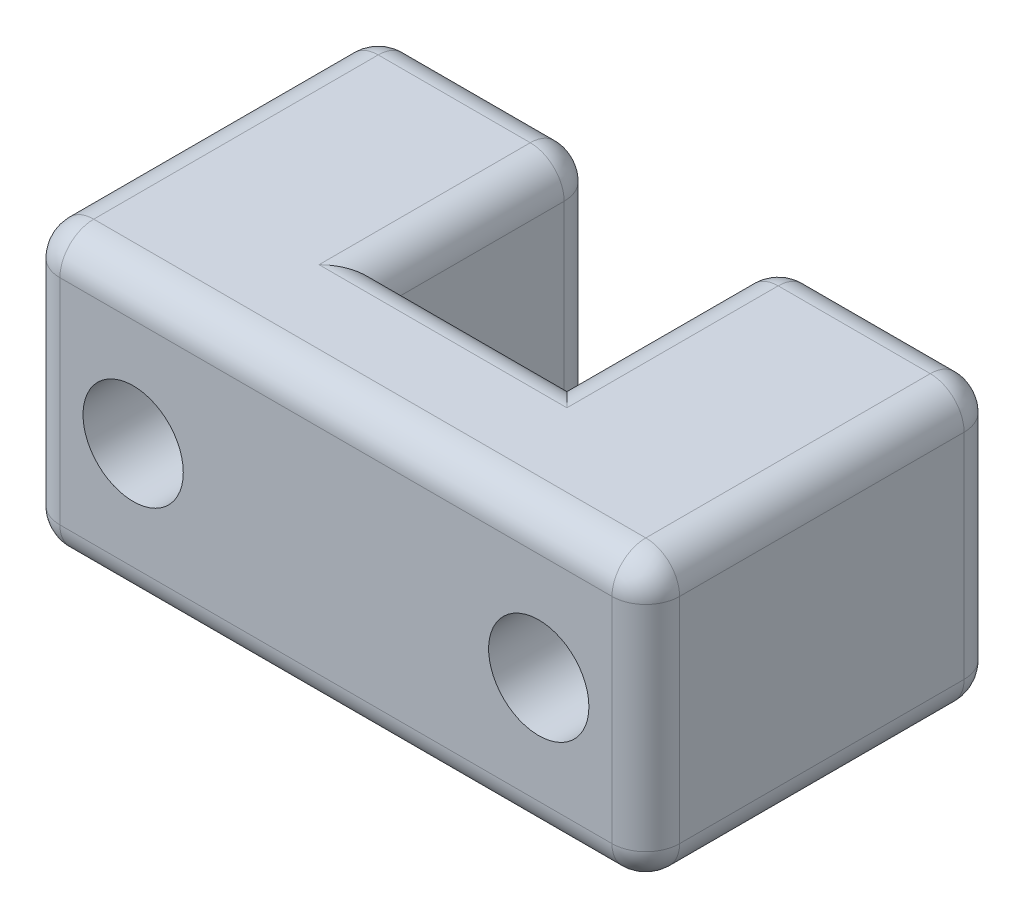
ISO-10303-21;
HEADER;
FILE_DESCRIPTION(('STEP AP214'),'2;1');
FILE_NAME('part.step','',(''),(''),'','','');
FILE_SCHEMA(('AUTOMOTIVE_DESIGN { 1 0 10303 214 1 1 1 1 }'));
ENDSEC;
DATA;
#1=APPLICATION_CONTEXT('core data for automotive mechanical design processes');
#2=APPLICATION_PROTOCOL_DEFINITION('international standard','automotive_design',2000,#1);
#3=PRODUCT_CONTEXT('',#1,'mechanical');
#4=PRODUCT('Part','Part','',(#3));
#5=PRODUCT_RELATED_PRODUCT_CATEGORY('part','',(#4));
#6=PRODUCT_DEFINITION_FORMATION('','',#4);
#7=PRODUCT_DEFINITION_CONTEXT('part definition',#1,'design');
#8=PRODUCT_DEFINITION('design','',#6,#7);
#9=PRODUCT_DEFINITION_SHAPE('','',#8);
#10=(LENGTH_UNIT() NAMED_UNIT(*) SI_UNIT(.MILLI.,.METRE.));
#11=(NAMED_UNIT(*) PLANE_ANGLE_UNIT() SI_UNIT($,.RADIAN.));
#12=(NAMED_UNIT(*) SI_UNIT($,.STERADIAN.) SOLID_ANGLE_UNIT());
#13=UNCERTAINTY_MEASURE_WITH_UNIT(LENGTH_MEASURE(1.E-05),#10,'distance_accuracy_value','');
#14=(GEOMETRIC_REPRESENTATION_CONTEXT(3) GLOBAL_UNCERTAINTY_ASSIGNED_CONTEXT((#13)) GLOBAL_UNIT_ASSIGNED_CONTEXT((#10,
#11,#12)) REPRESENTATION_CONTEXT('',''));
#15=CARTESIAN_POINT('',(0.,0.,0.));
#16=DIRECTION('',(0.,0.,1.));
#17=DIRECTION('',(1.,0.,0.));
#18=AXIS2_PLACEMENT_3D('',#15,#16,#17);
#19=CARTESIAN_POINT('',(0.,6.35,-7.9375));
#20=DIRECTION('',(1.,0.,0.));
#21=DIRECTION('',(0.,0.,-1.));
#22=AXIS2_PLACEMENT_3D('',#19,#20,#21);
#23=PLANE('',#22);
#24=DIRECTION('',(0.,-1.,0.));
#25=VECTOR('',#24,1.);
#26=CARTESIAN_POINT('',(0.,6.35,-7.1755));
#27=LINE('',#26,#25);
#28=CARTESIAN_POINT('',(0.,5.588,-7.1755));
#29=VERTEX_POINT('',#28);
#30=CARTESIAN_POINT('',(0.,0.762,-7.1755));
#31=VERTEX_POINT('',#30);
#32=EDGE_CURVE('E192',#29,#31,#27,.T.);
#33=ORIENTED_EDGE('',*,*,#32,.T.);
#34=DIRECTION('',(0.,0.,1.));
#35=VECTOR('',#34,1.);
#36=CARTESIAN_POINT('',(0.,0.762,-7.9375));
#37=LINE('',#36,#35);
#38=CARTESIAN_POINT('',(0.,0.762,-0.762));
#39=VERTEX_POINT('',#38);
#40=EDGE_CURVE('E188',#31,#39,#37,.T.);
#41=ORIENTED_EDGE('',*,*,#40,.T.);
#42=DIRECTION('',(0.,-1.,0.));
#43=VECTOR('',#42,1.);
#44=CARTESIAN_POINT('',(0.,6.35,-0.762));
#45=LINE('',#44,#43);
#46=CARTESIAN_POINT('',(0.,5.588,-0.762));
#47=VERTEX_POINT('',#46);
#48=EDGE_CURVE('E181',#39,#47,#45,.F.);
#49=ORIENTED_EDGE('',*,*,#48,.T.);
#50=DIRECTION('',(0.,0.,1.));
#51=VECTOR('',#50,1.);
#52=CARTESIAN_POINT('',(0.,5.588,-7.9375));
#53=LINE('',#52,#51);
#54=EDGE_CURVE('E185',#47,#29,#53,.F.);
#55=ORIENTED_EDGE('',*,*,#54,.T.);
#56=EDGE_LOOP('',(#33,#41,#49,#55));
#57=FACE_BOUND('',#56,.T.);
#58=ADVANCED_FACE('F33',(#57),#23,.F.);
#59=CARTESIAN_POINT('',(0.,6.35,0.));
#60=DIRECTION('',(0.,0.,-1.));
#61=DIRECTION('',(-1.,0.,0.));
#62=AXIS2_PLACEMENT_3D('',#59,#60,#61);
#63=PLANE('',#62);
#64=DIRECTION('',(0.,-1.,0.));
#65=VECTOR('',#64,1.);
#66=CARTESIAN_POINT('',(0.762,6.35,0.));
#67=LINE('',#66,#65);
#68=CARTESIAN_POINT('',(0.762,5.588,0.));
#69=VERTEX_POINT('',#68);
#70=CARTESIAN_POINT('',(0.762,0.762,0.));
#71=VERTEX_POINT('',#70);
#72=EDGE_CURVE('E200',#69,#71,#67,.T.);
#73=ORIENTED_EDGE('',*,*,#72,.T.);
#74=DIRECTION('',(1.,0.,0.));
#75=VECTOR('',#74,1.);
#76=CARTESIAN_POINT('',(0.,0.762,0.));
#77=LINE('',#76,#75);
#78=CARTESIAN_POINT('',(13.208,0.762,0.));
#79=VERTEX_POINT('',#78);
#80=EDGE_CURVE('E241',#71,#79,#77,.T.);
#81=ORIENTED_EDGE('',*,*,#80,.T.);
#82=DIRECTION('',(0.,-1.,0.));
#83=VECTOR('',#82,1.);
#84=CARTESIAN_POINT('',(13.208,6.35,0.));
#85=LINE('',#84,#83);
#86=CARTESIAN_POINT('',(13.208,5.588,0.));
#87=VERTEX_POINT('',#86);
#88=EDGE_CURVE('E238',#79,#87,#85,.F.);
#89=ORIENTED_EDGE('',*,*,#88,.T.);
#90=DIRECTION('',(1.,0.,0.));
#91=VECTOR('',#90,1.);
#92=CARTESIAN_POINT('',(0.,5.588,0.));
#93=LINE('',#92,#91);
#94=EDGE_CURVE('E236',#87,#69,#93,.F.);
#95=ORIENTED_EDGE('',*,*,#94,.T.);
#96=EDGE_LOOP('',(#73,#81,#89,#95));
#97=FACE_BOUND('',#96,.T.);
#98=CARTESIAN_POINT('',(2.413,3.175,0.));
#99=DIRECTION('',(0.,0.,1.));
#100=DIRECTION('',(1.,0.,0.));
#101=AXIS2_PLACEMENT_3D('',#98,#99,#100);
#102=CIRCLE('',#101,1.1303);
#103=CARTESIAN_POINT('',(3.5433,3.175,0.));
#104=VERTEX_POINT('',#103);
#105=EDGE_CURVE('E415',#104,#104,#102,.T.);
#106=ORIENTED_EDGE('',*,*,#105,.F.);
#107=EDGE_LOOP('',(#106));
#108=FACE_BOUND('',#107,.T.);
#109=CARTESIAN_POINT('',(11.557,3.175,0.));
#110=DIRECTION('',(0.,0.,1.));
#111=DIRECTION('',(1.,0.,0.));
#112=AXIS2_PLACEMENT_3D('',#109,#110,#111);
#113=CIRCLE('',#112,1.1303);
#114=CARTESIAN_POINT('',(12.6873,3.175,0.));
#115=VERTEX_POINT('',#114);
#116=EDGE_CURVE('E407',#115,#115,#113,.T.);
#117=ORIENTED_EDGE('',*,*,#116,.F.);
#118=EDGE_LOOP('',(#117));
#119=FACE_BOUND('',#118,.T.);
#120=ADVANCED_FACE('F432',(#97,#108,#119),#63,.F.);
#121=CARTESIAN_POINT('',(13.97,6.35,-7.9375));
#122=DIRECTION('',(-1.,0.,0.));
#123=DIRECTION('',(0.,0.,1.));
#124=AXIS2_PLACEMENT_3D('',#121,#122,#123);
#125=PLANE('',#124);
#126=DIRECTION('',(0.,-1.,0.));
#127=VECTOR('',#126,1.);
#128=CARTESIAN_POINT('',(13.97,6.35,-0.762));
#129=LINE('',#128,#127);
#130=CARTESIAN_POINT('',(13.97,5.588,-0.761999999999999));
#131=VERTEX_POINT('',#130);
#132=CARTESIAN_POINT('',(13.97,0.762,-0.761999999999999));
#133=VERTEX_POINT('',#132);
#134=EDGE_CURVE('E247',#131,#133,#129,.T.);
#135=ORIENTED_EDGE('',*,*,#134,.T.);
#136=DIRECTION('',(0.,0.,-1.));
#137=VECTOR('',#136,1.);
#138=CARTESIAN_POINT('',(13.97,0.762,-7.9375));
#139=LINE('',#138,#137);
#140=CARTESIAN_POINT('',(13.97,0.762,-7.1755));
#141=VERTEX_POINT('',#140);
#142=EDGE_CURVE('E250',#133,#141,#139,.T.);
#143=ORIENTED_EDGE('',*,*,#142,.T.);
#144=DIRECTION('',(0.,-1.,0.));
#145=VECTOR('',#144,1.);
#146=CARTESIAN_POINT('',(13.97,6.35,-7.1755));
#147=LINE('',#146,#145);
#148=CARTESIAN_POINT('',(13.97,5.588,-7.1755));
#149=VERTEX_POINT('',#148);
#150=EDGE_CURVE('E245',#141,#149,#147,.F.);
#151=ORIENTED_EDGE('',*,*,#150,.T.);
#152=DIRECTION('',(0.,0.,-1.));
#153=VECTOR('',#152,1.);
#154=CARTESIAN_POINT('',(13.97,5.588,0.));
#155=LINE('',#154,#153);
#156=EDGE_CURVE('E243',#149,#131,#155,.F.);
#157=ORIENTED_EDGE('',*,*,#156,.T.);
#158=EDGE_LOOP('',(#135,#143,#151,#157));
#159=FACE_BOUND('',#158,.T.);
#160=ADVANCED_FACE('F435',(#159),#125,.F.);
#161=CARTESIAN_POINT('',(9.017,6.35,-7.9375));
#162=DIRECTION('',(0.,0.,1.));
#163=DIRECTION('',(1.,0.,0.));
#164=AXIS2_PLACEMENT_3D('',#161,#162,#163);
#165=PLANE('',#164);
#166=DIRECTION('',(-1.,0.,0.));
#167=VECTOR('',#166,1.);
#168=CARTESIAN_POINT('',(13.97,5.588,-7.9375));
#169=LINE('',#168,#167);
#170=CARTESIAN_POINT('',(9.779,5.588,-7.9375));
#171=VERTEX_POINT('',#170);
#172=CARTESIAN_POINT('',(13.208,5.588,-7.9375));
#173=VERTEX_POINT('',#172);
#174=EDGE_CURVE('E254',#171,#173,#169,.F.);
#175=ORIENTED_EDGE('',*,*,#174,.T.);
#176=DIRECTION('',(0.,-1.,0.));
#177=VECTOR('',#176,1.);
#178=CARTESIAN_POINT('',(13.208,6.35,-7.9375));
#179=LINE('',#178,#177);
#180=CARTESIAN_POINT('',(13.208,0.762,-7.9375));
#181=VERTEX_POINT('',#180);
#182=EDGE_CURVE('E258',#173,#181,#179,.T.);
#183=ORIENTED_EDGE('',*,*,#182,.T.);
#184=DIRECTION('',(-1.,0.,0.));
#185=VECTOR('',#184,1.);
#186=CARTESIAN_POINT('',(9.017,0.762,-7.9375));
#187=LINE('',#186,#185);
#188=CARTESIAN_POINT('',(9.779,0.762,-7.9375));
#189=VERTEX_POINT('',#188);
#190=EDGE_CURVE('E256',#181,#189,#187,.T.);
#191=ORIENTED_EDGE('',*,*,#190,.T.);
#192=DIRECTION('',(0.,-1.,0.));
#193=VECTOR('',#192,1.);
#194=CARTESIAN_POINT('',(9.779,6.35,-7.9375));
#195=LINE('',#194,#193);
#196=EDGE_CURVE('E252',#189,#171,#195,.F.);
#197=ORIENTED_EDGE('',*,*,#196,.T.);
#198=EDGE_LOOP('',(#175,#183,#191,#197));
#199=FACE_BOUND('',#198,.T.);
#200=CARTESIAN_POINT('',(11.557,3.175,-7.9375));
#201=DIRECTION('',(0.,0.,1.));
#202=DIRECTION('',(1.,0.,0.));
#203=AXIS2_PLACEMENT_3D('',#200,#201,#202);
#204=CIRCLE('',#203,1.1303);
#205=CARTESIAN_POINT('',(12.6873,3.175,-7.9375));
#206=VERTEX_POINT('',#205);
#207=EDGE_CURVE('E410',#206,#206,#204,.F.);
#208=ORIENTED_EDGE('',*,*,#207,.F.);
#209=EDGE_LOOP('',(#208));
#210=FACE_BOUND('',#209,.T.);
#211=ADVANCED_FACE('F442',(#199,#210),#165,.F.);
#212=CARTESIAN_POINT('',(9.017,6.35,-3.175));
#213=DIRECTION('',(1.,0.,0.));
#214=DIRECTION('',(0.,0.,-1.));
#215=AXIS2_PLACEMENT_3D('',#212,#213,#214);
#216=PLANE('',#215);
#217=DIRECTION('',(0.,-1.,0.));
#218=VECTOR('',#217,1.);
#219=CARTESIAN_POINT('',(9.017,6.35,-7.1755));
#220=LINE('',#219,#218);
#221=CARTESIAN_POINT('',(9.017,5.588,-7.1755));
#222=VERTEX_POINT('',#221);
#223=CARTESIAN_POINT('',(9.017,0.762,-7.1755));
#224=VERTEX_POINT('',#223);
#225=EDGE_CURVE('E278',#222,#224,#220,.T.);
#226=ORIENTED_EDGE('',*,*,#225,.T.);
#227=DIRECTION('',(0.,0.,1.));
#228=VECTOR('',#227,1.);
#229=CARTESIAN_POINT('',(9.017,0.762,-3.175));
#230=LINE('',#229,#228);
#231=CARTESIAN_POINT('',(9.017,0.762,-3.175));
#232=VERTEX_POINT('',#231);
#233=EDGE_CURVE('E282',#224,#232,#230,.T.);
#234=ORIENTED_EDGE('',*,*,#233,.T.);
#235=DIRECTION('',(0.,-1.,0.));
#236=VECTOR('',#235,1.);
#237=CARTESIAN_POINT('',(9.017,6.35,-3.175));
#238=LINE('',#237,#236);
#239=CARTESIAN_POINT('',(9.017,5.588,-3.175));
#240=VERTEX_POINT('',#239);
#241=EDGE_CURVE('E218',#240,#232,#238,.T.);
#242=ORIENTED_EDGE('',*,*,#241,.F.);
#243=DIRECTION('',(0.,0.,1.));
#244=VECTOR('',#243,1.);
#245=CARTESIAN_POINT('',(9.017,5.588,-7.9375));
#246=LINE('',#245,#244);
#247=EDGE_CURVE('E280',#240,#222,#246,.F.);
#248=ORIENTED_EDGE('',*,*,#247,.T.);
#249=EDGE_LOOP('',(#226,#234,#242,#248));
#250=FACE_BOUND('',#249,.T.);
#251=ADVANCED_FACE('F595',(#250),#216,.F.);
#252=CARTESIAN_POINT('',(4.953,6.35,-3.175));
#253=DIRECTION('',(0.,0.,1.));
#254=DIRECTION('',(1.,0.,0.));
#255=AXIS2_PLACEMENT_3D('',#252,#253,#254);
#256=PLANE('',#255);
#257=ORIENTED_EDGE('',*,*,#241,.T.);
#258=DIRECTION('',(-1.,0.,0.));
#259=VECTOR('',#258,1.);
#260=CARTESIAN_POINT('',(4.953,0.762,-3.175));
#261=LINE('',#260,#259);
#262=CARTESIAN_POINT('',(4.953,0.762,-3.175));
#263=VERTEX_POINT('',#262);
#264=EDGE_CURVE('E287',#232,#263,#261,.T.);
#265=ORIENTED_EDGE('',*,*,#264,.T.);
#266=DIRECTION('',(0.,-1.,0.));
#267=VECTOR('',#266,1.);
#268=CARTESIAN_POINT('',(4.953,6.35,-3.175));
#269=LINE('',#268,#267);
#270=CARTESIAN_POINT('',(4.953,5.588,-3.175));
#271=VERTEX_POINT('',#270);
#272=EDGE_CURVE('E221',#271,#263,#269,.T.);
#273=ORIENTED_EDGE('',*,*,#272,.F.);
#274=DIRECTION('',(-1.,0.,0.));
#275=VECTOR('',#274,1.);
#276=CARTESIAN_POINT('',(9.017,5.588,-3.175));
#277=LINE('',#276,#275);
#278=EDGE_CURVE('E285',#271,#240,#277,.F.);
#279=ORIENTED_EDGE('',*,*,#278,.T.);
#280=EDGE_LOOP('',(#257,#265,#273,#279));
#281=FACE_BOUND('',#280,.T.);
#282=ADVANCED_FACE('F632',(#281),#256,.F.);
#283=CARTESIAN_POINT('',(4.953,6.35,-7.9375));
#284=DIRECTION('',(-1.,0.,0.));
#285=DIRECTION('',(0.,0.,1.));
#286=AXIS2_PLACEMENT_3D('',#283,#284,#285);
#287=PLANE('',#286);
#288=ORIENTED_EDGE('',*,*,#272,.T.);
#289=DIRECTION('',(0.,0.,-1.));
#290=VECTOR('',#289,1.);
#291=CARTESIAN_POINT('',(4.953,0.762,-7.9375));
#292=LINE('',#291,#290);
#293=CARTESIAN_POINT('',(4.953,0.762,-7.1755));
#294=VERTEX_POINT('',#293);
#295=EDGE_CURVE('E293',#263,#294,#292,.T.);
#296=ORIENTED_EDGE('',*,*,#295,.T.);
#297=DIRECTION('',(0.,-1.,0.));
#298=VECTOR('',#297,1.);
#299=CARTESIAN_POINT('',(4.953,6.35,-7.1755));
#300=LINE('',#299,#298);
#301=CARTESIAN_POINT('',(4.953,5.588,-7.1755));
#302=VERTEX_POINT('',#301);
#303=EDGE_CURVE('E289',#294,#302,#300,.F.);
#304=ORIENTED_EDGE('',*,*,#303,.T.);
#305=DIRECTION('',(0.,0.,-1.));
#306=VECTOR('',#305,1.);
#307=CARTESIAN_POINT('',(4.953,5.588,-3.175));
#308=LINE('',#307,#306);
#309=EDGE_CURVE('E291',#302,#271,#308,.F.);
#310=ORIENTED_EDGE('',*,*,#309,.T.);
#311=EDGE_LOOP('',(#288,#296,#304,#310));
#312=FACE_BOUND('',#311,.T.);
#313=ADVANCED_FACE('F634',(#312),#287,.F.);
#314=CARTESIAN_POINT('',(0.,6.35,-7.9375));
#315=DIRECTION('',(0.,0.,1.));
#316=DIRECTION('',(1.,0.,0.));
#317=AXIS2_PLACEMENT_3D('',#314,#315,#316);
#318=PLANE('',#317);
#319=DIRECTION('',(-1.,0.,0.));
#320=VECTOR('',#319,1.);
#321=CARTESIAN_POINT('',(0.,0.762,-7.9375));
#322=LINE('',#321,#320);
#323=CARTESIAN_POINT('',(4.191,0.762,-7.9375));
#324=VERTEX_POINT('',#323);
#325=CARTESIAN_POINT('',(0.762,0.762,-7.9375));
#326=VERTEX_POINT('',#325);
#327=EDGE_CURVE('E231',#324,#326,#322,.T.);
#328=ORIENTED_EDGE('',*,*,#327,.T.);
#329=DIRECTION('',(0.,-1.,0.));
#330=VECTOR('',#329,1.);
#331=CARTESIAN_POINT('',(0.762,6.35,-7.9375));
#332=LINE('',#331,#330);
#333=CARTESIAN_POINT('',(0.762,5.588,-7.9375));
#334=VERTEX_POINT('',#333);
#335=EDGE_CURVE('E233',#326,#334,#332,.F.);
#336=ORIENTED_EDGE('',*,*,#335,.T.);
#337=DIRECTION('',(-1.,0.,0.));
#338=VECTOR('',#337,1.);
#339=CARTESIAN_POINT('',(4.953,5.588,-7.9375));
#340=LINE('',#339,#338);
#341=CARTESIAN_POINT('',(4.191,5.588,-7.9375));
#342=VERTEX_POINT('',#341);
#343=EDGE_CURVE('E229',#334,#342,#340,.F.);
#344=ORIENTED_EDGE('',*,*,#343,.T.);
#345=DIRECTION('',(0.,-1.,0.));
#346=VECTOR('',#345,1.);
#347=CARTESIAN_POINT('',(4.191,6.35,-7.9375));
#348=LINE('',#347,#346);
#349=EDGE_CURVE('E227',#342,#324,#348,.T.);
#350=ORIENTED_EDGE('',*,*,#349,.T.);
#351=EDGE_LOOP('',(#328,#336,#344,#350));
#352=FACE_BOUND('',#351,.T.);
#353=CARTESIAN_POINT('',(2.413,3.175,-7.9375));
#354=DIRECTION('',(0.,0.,1.));
#355=DIRECTION('',(1.,0.,0.));
#356=AXIS2_PLACEMENT_3D('',#353,#354,#355);
#357=CIRCLE('',#356,1.1303);
#358=CARTESIAN_POINT('',(3.5433,3.175,-7.9375));
#359=VERTEX_POINT('',#358);
#360=EDGE_CURVE('E418',#359,#359,#357,.F.);
#361=ORIENTED_EDGE('',*,*,#360,.F.);
#362=EDGE_LOOP('',(#361));
#363=FACE_BOUND('',#362,.T.);
#364=ADVANCED_FACE('F640',(#352,#363),#318,.F.);
#365=CARTESIAN_POINT('',(0.,6.35,0.));
#366=DIRECTION('',(0.,1.,0.));
#367=DIRECTION('',(0.,0.,1.));
#368=AXIS2_PLACEMENT_3D('',#365,#366,#367);
#369=PLANE('',#368);
#370=DIRECTION('',(0.,0.,-1.));
#371=VECTOR('',#370,1.);
#372=CARTESIAN_POINT('',(4.191,6.35,-7.9375));
#373=LINE('',#372,#371);
#374=CARTESIAN_POINT('',(4.191,6.35,-2.413));
#375=VERTEX_POINT('',#374);
#376=CARTESIAN_POINT('',(4.191,6.35,-7.1755));
#377=VERTEX_POINT('',#376);
#378=EDGE_CURVE('E42',#375,#377,#373,.T.);
#379=ORIENTED_EDGE('',*,*,#378,.T.);
#380=DIRECTION('',(-1.,0.,0.));
#381=VECTOR('',#380,1.);
#382=CARTESIAN_POINT('',(0.,6.35,-7.1755));
#383=LINE('',#382,#381);
#384=CARTESIAN_POINT('',(0.762,6.35,-7.1755));
#385=VERTEX_POINT('',#384);
#386=EDGE_CURVE('E11',#377,#385,#383,.T.);
#387=ORIENTED_EDGE('',*,*,#386,.T.);
#388=DIRECTION('',(0.,0.,1.));
#389=VECTOR('',#388,1.);
#390=CARTESIAN_POINT('',(0.762,6.35,0.));
#391=LINE('',#390,#389);
#392=CARTESIAN_POINT('',(0.762,6.35,-0.762));
#393=VERTEX_POINT('',#392);
#394=EDGE_CURVE('E295',#385,#393,#391,.T.);
#395=ORIENTED_EDGE('',*,*,#394,.T.);
#396=DIRECTION('',(1.,0.,0.));
#397=VECTOR('',#396,1.);
#398=CARTESIAN_POINT('',(13.97,6.35,-0.762));
#399=LINE('',#398,#397);
#400=CARTESIAN_POINT('',(13.208,6.35,-0.762));
#401=VERTEX_POINT('',#400);
#402=EDGE_CURVE('E297',#393,#401,#399,.T.);
#403=ORIENTED_EDGE('',*,*,#402,.T.);
#404=DIRECTION('',(0.,0.,-1.));
#405=VECTOR('',#404,1.);
#406=CARTESIAN_POINT('',(13.208,6.35,-7.9375));
#407=LINE('',#406,#405);
#408=CARTESIAN_POINT('',(13.208,6.35,-7.1755));
#409=VERTEX_POINT('',#408);
#410=EDGE_CURVE('E299',#401,#409,#407,.T.);
#411=ORIENTED_EDGE('',*,*,#410,.T.);
#412=DIRECTION('',(-1.,0.,0.));
#413=VECTOR('',#412,1.);
#414=CARTESIAN_POINT('',(9.017,6.35,-7.1755));
#415=LINE('',#414,#413);
#416=CARTESIAN_POINT('',(9.779,6.35,-7.1755));
#417=VERTEX_POINT('',#416);
#418=EDGE_CURVE('E301',#409,#417,#415,.T.);
#419=ORIENTED_EDGE('',*,*,#418,.T.);
#420=DIRECTION('',(0.,0.,1.));
#421=VECTOR('',#420,1.);
#422=CARTESIAN_POINT('',(9.779,6.35,-3.175));
#423=LINE('',#422,#421);
#424=CARTESIAN_POINT('',(9.779,6.35,-2.413));
#425=VERTEX_POINT('',#424);
#426=EDGE_CURVE('E303',#417,#425,#423,.T.);
#427=ORIENTED_EDGE('',*,*,#426,.T.);
#428=DIRECTION('',(-1.,0.,0.));
#429=VECTOR('',#428,1.);
#430=CARTESIAN_POINT('',(4.953,6.35,-2.413));
#431=LINE('',#430,#429);
#432=EDGE_CURVE('E53',#425,#375,#431,.T.);
#433=ORIENTED_EDGE('',*,*,#432,.T.);
#434=EDGE_LOOP('',(#379,#387,#395,#403,#411,#419,#427,#433));
#435=FACE_BOUND('',#434,.T.);
#436=ADVANCED_FACE('F608',(#435),#369,.T.);
#437=CARTESIAN_POINT('',(0.,0.,0.));
#438=DIRECTION('',(0.,1.,0.));
#439=DIRECTION('',(0.,0.,1.));
#440=AXIS2_PLACEMENT_3D('',#437,#438,#439);
#441=PLANE('',#440);
#442=DIRECTION('',(0.,0.,-1.));
#443=VECTOR('',#442,1.);
#444=CARTESIAN_POINT('',(13.208,0.,0.));
#445=LINE('',#444,#443);
#446=CARTESIAN_POINT('',(13.208,0.,-7.1755));
#447=VERTEX_POINT('',#446);
#448=CARTESIAN_POINT('',(13.208,0.,-0.762));
#449=VERTEX_POINT('',#448);
#450=EDGE_CURVE('E273',#447,#449,#445,.F.);
#451=ORIENTED_EDGE('',*,*,#450,.T.);
#452=DIRECTION('',(1.,0.,0.));
#453=VECTOR('',#452,1.);
#454=CARTESIAN_POINT('',(0.,0.,-0.762));
#455=LINE('',#454,#453);
#456=CARTESIAN_POINT('',(0.762,0.,-0.762));
#457=VERTEX_POINT('',#456);
#458=EDGE_CURVE('E275',#449,#457,#455,.F.);
#459=ORIENTED_EDGE('',*,*,#458,.T.);
#460=DIRECTION('',(0.,0.,1.));
#461=VECTOR('',#460,1.);
#462=CARTESIAN_POINT('',(0.762,0.,0.));
#463=LINE('',#462,#461);
#464=CARTESIAN_POINT('',(0.762,0.,-7.1755));
#465=VERTEX_POINT('',#464);
#466=EDGE_CURVE('E261',#457,#465,#463,.F.);
#467=ORIENTED_EDGE('',*,*,#466,.T.);
#468=DIRECTION('',(-1.,0.,0.));
#469=VECTOR('',#468,1.);
#470=CARTESIAN_POINT('',(0.,0.,-7.1755));
#471=LINE('',#470,#469);
#472=CARTESIAN_POINT('',(4.191,0.,-7.1755));
#473=VERTEX_POINT('',#472);
#474=EDGE_CURVE('E263',#465,#473,#471,.F.);
#475=ORIENTED_EDGE('',*,*,#474,.T.);
#476=DIRECTION('',(0.,0.,-1.));
#477=VECTOR('',#476,1.);
#478=CARTESIAN_POINT('',(4.191,0.,0.));
#479=LINE('',#478,#477);
#480=CARTESIAN_POINT('',(4.191,0.,-2.413));
#481=VERTEX_POINT('',#480);
#482=EDGE_CURVE('E265',#473,#481,#479,.F.);
#483=ORIENTED_EDGE('',*,*,#482,.T.);
#484=DIRECTION('',(-1.,0.,0.));
#485=VECTOR('',#484,1.);
#486=CARTESIAN_POINT('',(0.,0.,-2.413));
#487=LINE('',#486,#485);
#488=CARTESIAN_POINT('',(9.779,0.,-2.413));
#489=VERTEX_POINT('',#488);
#490=EDGE_CURVE('E267',#481,#489,#487,.F.);
#491=ORIENTED_EDGE('',*,*,#490,.T.);
#492=DIRECTION('',(0.,0.,1.));
#493=VECTOR('',#492,1.);
#494=CARTESIAN_POINT('',(9.779,0.,0.));
#495=LINE('',#494,#493);
#496=CARTESIAN_POINT('',(9.779,0.,-7.1755));
#497=VERTEX_POINT('',#496);
#498=EDGE_CURVE('E269',#489,#497,#495,.F.);
#499=ORIENTED_EDGE('',*,*,#498,.T.);
#500=DIRECTION('',(-1.,0.,0.));
#501=VECTOR('',#500,1.);
#502=CARTESIAN_POINT('',(0.,0.,-7.1755));
#503=LINE('',#502,#501);
#504=EDGE_CURVE('E271',#497,#447,#503,.F.);
#505=ORIENTED_EDGE('',*,*,#504,.T.);
#506=EDGE_LOOP('',(#451,#459,#467,#475,#483,#491,#499,#505));
#507=FACE_BOUND('',#506,.T.);
#508=ADVANCED_FACE('F625',(#507),#441,.F.);
#509=CARTESIAN_POINT('',(2.413,3.175,-11.1344711791006));
#510=DIRECTION('',(0.,0.,1.));
#511=DIRECTION('',(1.,0.,0.));
#512=AXIS2_PLACEMENT_3D('',#509,#510,#511);
#513=CYLINDRICAL_SURFACE('',#512,1.1303);
#514=ORIENTED_EDGE('',*,*,#360,.T.);
#515=EDGE_LOOP('',(#514));
#516=FACE_BOUND('',#515,.T.);
#517=ORIENTED_EDGE('',*,*,#105,.T.);
#518=EDGE_LOOP('',(#517));
#519=FACE_BOUND('',#518,.T.);
#520=ADVANCED_FACE('F430',(#516,#519),#513,.F.);
#521=CARTESIAN_POINT('',(11.557,3.175,-11.1344711791006));
#522=DIRECTION('',(0.,0.,1.));
#523=DIRECTION('',(1.,0.,0.));
#524=AXIS2_PLACEMENT_3D('',#521,#522,#523);
#525=CYLINDRICAL_SURFACE('',#524,1.1303);
#526=ORIENTED_EDGE('',*,*,#207,.T.);
#527=EDGE_LOOP('',(#526));
#528=FACE_BOUND('',#527,.T.);
#529=ORIENTED_EDGE('',*,*,#116,.T.);
#530=EDGE_LOOP('',(#529));
#531=FACE_BOUND('',#530,.T.);
#532=ADVANCED_FACE('F574',(#528,#531),#525,.F.);
#533=CARTESIAN_POINT('',(0.,5.588,-7.1755));
#534=DIRECTION('',(1.,0.,0.));
#535=DIRECTION('',(0.,0.,-1.));
#536=AXIS2_PLACEMENT_3D('',#533,#534,#535);
#537=CYLINDRICAL_SURFACE('',#536,0.762);
#538=CARTESIAN_POINT('',(13.208,5.588,-7.1755));
#539=DIRECTION('',(1.,0.,0.));
#540=DIRECTION('',(0.,0.,-1.));
#541=AXIS2_PLACEMENT_3D('',#538,#539,#540);
#542=CIRCLE('',#541,0.762);
#543=EDGE_CURVE('E399',#173,#409,#542,.T.);
#544=ORIENTED_EDGE('',*,*,#543,.F.);
#545=ORIENTED_EDGE('',*,*,#174,.F.);
#546=CARTESIAN_POINT('',(9.779,5.588,-7.1755));
#547=DIRECTION('',(-1.,0.,0.));
#548=DIRECTION('',(0.,0.,1.));
#549=AXIS2_PLACEMENT_3D('',#546,#547,#548);
#550=CIRCLE('',#549,0.762);
#551=EDGE_CURVE('E401',#417,#171,#550,.T.);
#552=ORIENTED_EDGE('',*,*,#551,.F.);
#553=ORIENTED_EDGE('',*,*,#418,.F.);
#554=EDGE_LOOP('',(#544,#545,#552,#553));
#555=FACE_BOUND('',#554,.T.);
#556=ADVANCED_FACE('F35',(#555),#537,.T.);
#557=CARTESIAN_POINT('',(13.208,6.35,-7.1755));
#558=DIRECTION('',(0.,-1.,0.));
#559=DIRECTION('',(0.,0.,-1.));
#560=AXIS2_PLACEMENT_3D('',#557,#558,#559);
#561=CYLINDRICAL_SURFACE('',#560,0.762);
#562=CARTESIAN_POINT('',(13.208,0.762,-7.1755));
#563=DIRECTION('',(0.,-1.,0.));
#564=DIRECTION('',(0.,0.,-1.));
#565=AXIS2_PLACEMENT_3D('',#562,#563,#564);
#566=CIRCLE('',#565,0.762);
#567=EDGE_CURVE('E393',#181,#141,#566,.T.);
#568=ORIENTED_EDGE('',*,*,#567,.F.);
#569=ORIENTED_EDGE('',*,*,#182,.F.);
#570=CARTESIAN_POINT('',(13.208,5.588,-7.1755));
#571=DIRECTION('',(0.,1.,0.));
#572=DIRECTION('',(0.,0.,1.));
#573=AXIS2_PLACEMENT_3D('',#570,#571,#572);
#574=CIRCLE('',#573,0.762);
#575=EDGE_CURVE('E396',#149,#173,#574,.T.);
#576=ORIENTED_EDGE('',*,*,#575,.F.);
#577=ORIENTED_EDGE('',*,*,#150,.F.);
#578=EDGE_LOOP('',(#568,#569,#576,#577));
#579=FACE_BOUND('',#578,.T.);
#580=ADVANCED_FACE('F567',(#579),#561,.T.);
#581=CARTESIAN_POINT('',(9.017,0.762,-7.1755));
#582=DIRECTION('',(-1.,0.,0.));
#583=DIRECTION('',(0.,0.,1.));
#584=AXIS2_PLACEMENT_3D('',#581,#582,#583);
#585=CYLINDRICAL_SURFACE('',#584,0.762);
#586=CARTESIAN_POINT('',(9.779,0.762,-7.1755));
#587=DIRECTION('',(-1.,0.,0.));
#588=DIRECTION('',(0.,0.,1.));
#589=AXIS2_PLACEMENT_3D('',#586,#587,#588);
#590=CIRCLE('',#589,0.762);
#591=EDGE_CURVE('E388',#189,#497,#590,.T.);
#592=ORIENTED_EDGE('',*,*,#591,.F.);
#593=ORIENTED_EDGE('',*,*,#190,.F.);
#594=CARTESIAN_POINT('',(13.208,0.762,-7.1755));
#595=DIRECTION('',(1.,0.,0.));
#596=DIRECTION('',(0.,0.,-1.));
#597=AXIS2_PLACEMENT_3D('',#594,#595,#596);
#598=CIRCLE('',#597,0.762);
#599=EDGE_CURVE('E391',#447,#181,#598,.T.);
#600=ORIENTED_EDGE('',*,*,#599,.F.);
#601=ORIENTED_EDGE('',*,*,#504,.F.);
#602=EDGE_LOOP('',(#592,#593,#600,#601));
#603=FACE_BOUND('',#602,.T.);
#604=ADVANCED_FACE('F564',(#603),#585,.T.);
#605=CARTESIAN_POINT('',(9.779,6.35,-7.1755));
#606=DIRECTION('',(0.,-1.,0.));
#607=DIRECTION('',(0.,0.,-1.));
#608=AXIS2_PLACEMENT_3D('',#605,#606,#607);
#609=CYLINDRICAL_SURFACE('',#608,0.762);
#610=CARTESIAN_POINT('',(9.779,5.588,-7.1755));
#611=DIRECTION('',(0.,1.,0.));
#612=DIRECTION('',(0.,0.,1.));
#613=AXIS2_PLACEMENT_3D('',#610,#611,#612);
#614=CIRCLE('',#613,0.762);
#615=EDGE_CURVE('E37',#171,#222,#614,.T.);
#616=ORIENTED_EDGE('',*,*,#615,.F.);
#617=ORIENTED_EDGE('',*,*,#196,.F.);
#618=CARTESIAN_POINT('',(9.779,0.762,-7.1755));
#619=DIRECTION('',(0.,-1.,0.));
#620=DIRECTION('',(0.,0.,-1.));
#621=AXIS2_PLACEMENT_3D('',#618,#619,#620);
#622=CIRCLE('',#621,0.762);
#623=EDGE_CURVE('E385',#224,#189,#622,.T.);
#624=ORIENTED_EDGE('',*,*,#623,.F.);
#625=ORIENTED_EDGE('',*,*,#225,.F.);
#626=EDGE_LOOP('',(#616,#617,#624,#625));
#627=FACE_BOUND('',#626,.T.);
#628=ADVANCED_FACE('F561',(#627),#609,.T.);
#629=CARTESIAN_POINT('',(9.779,5.588,-7.1755));
#630=DIRECTION('',(0.,0.,1.));
#631=DIRECTION('',(1.,0.,0.));
#632=AXIS2_PLACEMENT_3D('',#629,#630,#631);
#633=SPHERICAL_SURFACE('',#632,0.762);
#634=ORIENTED_EDGE('',*,*,#551,.T.);
#635=ORIENTED_EDGE('',*,*,#615,.T.);
#636=CARTESIAN_POINT('',(9.779,5.588,-7.1755));
#637=DIRECTION('',(0.,0.,-1.));
#638=DIRECTION('',(-1.,0.,0.));
#639=AXIS2_PLACEMENT_3D('',#636,#637,#638);
#640=CIRCLE('',#639,0.762);
#641=EDGE_CURVE('E382',#417,#222,#640,.F.);
#642=ORIENTED_EDGE('',*,*,#641,.F.);
#643=EDGE_LOOP('',(#634,#635,#642));
#644=FACE_BOUND('',#643,.T.);
#645=ADVANCED_FACE('F557',(#644),#633,.T.);
#646=CARTESIAN_POINT('',(13.208,5.588,-7.1755));
#647=DIRECTION('',(0.,0.,1.));
#648=DIRECTION('',(1.,0.,0.));
#649=AXIS2_PLACEMENT_3D('',#646,#647,#648);
#650=SPHERICAL_SURFACE('',#649,0.762);
#651=ORIENTED_EDGE('',*,*,#575,.T.);
#652=ORIENTED_EDGE('',*,*,#543,.T.);
#653=CARTESIAN_POINT('',(13.208,5.588,-7.1755));
#654=DIRECTION('',(0.,0.,-1.));
#655=DIRECTION('',(-1.,0.,0.));
#656=AXIS2_PLACEMENT_3D('',#653,#654,#655);
#657=CIRCLE('',#656,0.762);
#658=EDGE_CURVE('E379',#149,#409,#657,.F.);
#659=ORIENTED_EDGE('',*,*,#658,.F.);
#660=EDGE_LOOP('',(#651,#652,#659));
#661=FACE_BOUND('',#660,.T.);
#662=ADVANCED_FACE('F553',(#661),#650,.T.);
#663=CARTESIAN_POINT('',(13.208,0.762,-7.1755));
#664=DIRECTION('',(0.,0.,1.));
#665=DIRECTION('',(1.,0.,0.));
#666=AXIS2_PLACEMENT_3D('',#663,#664,#665);
#667=SPHERICAL_SURFACE('',#666,0.762);
#668=ORIENTED_EDGE('',*,*,#599,.T.);
#669=ORIENTED_EDGE('',*,*,#567,.T.);
#670=CARTESIAN_POINT('',(13.208,0.762,-7.1755));
#671=DIRECTION('',(0.,0.,-1.));
#672=DIRECTION('',(-1.,0.,0.));
#673=AXIS2_PLACEMENT_3D('',#670,#671,#672);
#674=CIRCLE('',#673,0.762);
#675=EDGE_CURVE('E376',#447,#141,#674,.F.);
#676=ORIENTED_EDGE('',*,*,#675,.F.);
#677=EDGE_LOOP('',(#668,#669,#676));
#678=FACE_BOUND('',#677,.T.);
#679=ADVANCED_FACE('F549',(#678),#667,.T.);
#680=CARTESIAN_POINT('',(9.779,0.762,-7.1755));
#681=DIRECTION('',(0.,0.,1.));
#682=DIRECTION('',(1.,0.,0.));
#683=AXIS2_PLACEMENT_3D('',#680,#681,#682);
#684=SPHERICAL_SURFACE('',#683,0.762);
#685=ORIENTED_EDGE('',*,*,#623,.T.);
#686=ORIENTED_EDGE('',*,*,#591,.T.);
#687=CARTESIAN_POINT('',(9.779,0.762,-7.1755));
#688=DIRECTION('',(0.,0.,-1.));
#689=DIRECTION('',(-1.,0.,0.));
#690=AXIS2_PLACEMENT_3D('',#687,#688,#689);
#691=CIRCLE('',#690,0.762);
#692=EDGE_CURVE('E373',#224,#497,#691,.F.);
#693=ORIENTED_EDGE('',*,*,#692,.F.);
#694=EDGE_LOOP('',(#685,#686,#693));
#695=FACE_BOUND('',#694,.T.);
#696=ADVANCED_FACE('F545',(#695),#684,.T.);
#697=CARTESIAN_POINT('',(9.779,5.588,0.));
#698=DIRECTION('',(0.,0.,-1.));
#699=DIRECTION('',(-1.,0.,0.));
#700=AXIS2_PLACEMENT_3D('',#697,#698,#699);
#701=CYLINDRICAL_SURFACE('',#700,0.762);
#702=ORIENTED_EDGE('',*,*,#641,.T.);
#703=ORIENTED_EDGE('',*,*,#247,.F.);
#704=CARTESIAN_POINT('',(9.779,5.588,-2.413));
#705=DIRECTION('',(0.707106781186547,0.,-0.707106781186547));
#706=DIRECTION('',(0.707106781186547,0.,0.707106781186547));
#707=AXIS2_PLACEMENT_3D('',#704,#705,#706);
#708=ELLIPSE('',#707,1.0776307345283,0.762);
#709=EDGE_CURVE('E370',#425,#240,#708,.F.);
#710=ORIENTED_EDGE('',*,*,#709,.F.);
#711=ORIENTED_EDGE('',*,*,#426,.F.);
#712=EDGE_LOOP('',(#702,#703,#710,#711));
#713=FACE_BOUND('',#712,.T.);
#714=ADVANCED_FACE('F541',(#713),#701,.T.);
#715=CARTESIAN_POINT('',(13.208,5.588,0.));
#716=DIRECTION('',(0.,0.,1.));
#717=DIRECTION('',(1.,0.,0.));
#718=AXIS2_PLACEMENT_3D('',#715,#716,#717);
#719=CYLINDRICAL_SURFACE('',#718,0.762);
#720=ORIENTED_EDGE('',*,*,#658,.T.);
#721=ORIENTED_EDGE('',*,*,#410,.F.);
#722=CARTESIAN_POINT('',(13.208,5.588,-0.762));
#723=DIRECTION('',(0.,0.,1.));
#724=DIRECTION('',(0.,-1.,0.));
#725=AXIS2_PLACEMENT_3D('',#722,#723,#724);
#726=CIRCLE('',#725,0.762);
#727=EDGE_CURVE('E367',#131,#401,#726,.T.);
#728=ORIENTED_EDGE('',*,*,#727,.F.);
#729=ORIENTED_EDGE('',*,*,#156,.F.);
#730=EDGE_LOOP('',(#720,#721,#728,#729));
#731=FACE_BOUND('',#730,.T.);
#732=ADVANCED_FACE('F537',(#731),#719,.T.);
#733=CARTESIAN_POINT('',(13.208,6.35,-0.762));
#734=DIRECTION('',(0.,-1.,0.));
#735=DIRECTION('',(0.,0.,-1.));
#736=AXIS2_PLACEMENT_3D('',#733,#734,#735);
#737=CYLINDRICAL_SURFACE('',#736,0.762);
#738=CARTESIAN_POINT('',(13.208,0.762,-0.762));
#739=DIRECTION('',(0.,-1.,0.));
#740=DIRECTION('',(0.,0.,-1.));
#741=AXIS2_PLACEMENT_3D('',#738,#739,#740);
#742=CIRCLE('',#741,0.762);
#743=EDGE_CURVE('E361',#133,#79,#742,.T.);
#744=ORIENTED_EDGE('',*,*,#743,.F.);
#745=ORIENTED_EDGE('',*,*,#134,.F.);
#746=CARTESIAN_POINT('',(13.208,5.588,-0.762));
#747=DIRECTION('',(0.,1.,0.));
#748=DIRECTION('',(0.,0.,1.));
#749=AXIS2_PLACEMENT_3D('',#746,#747,#748);
#750=CIRCLE('',#749,0.762);
#751=EDGE_CURVE('E364',#87,#131,#750,.T.);
#752=ORIENTED_EDGE('',*,*,#751,.F.);
#753=ORIENTED_EDGE('',*,*,#88,.F.);
#754=EDGE_LOOP('',(#744,#745,#752,#753));
#755=FACE_BOUND('',#754,.T.);
#756=ADVANCED_FACE('F533',(#755),#737,.T.);
#757=CARTESIAN_POINT('',(13.208,0.762,-7.9375));
#758=DIRECTION('',(0.,0.,-1.));
#759=DIRECTION('',(-1.,0.,0.));
#760=AXIS2_PLACEMENT_3D('',#757,#758,#759);
#761=CYLINDRICAL_SURFACE('',#760,0.762);
#762=ORIENTED_EDGE('',*,*,#675,.T.);
#763=ORIENTED_EDGE('',*,*,#142,.F.);
#764=CARTESIAN_POINT('',(13.208,0.762,-0.762));
#765=DIRECTION('',(0.,0.,1.));
#766=DIRECTION('',(1.,0.,0.));
#767=AXIS2_PLACEMENT_3D('',#764,#765,#766);
#768=CIRCLE('',#767,0.762);
#769=EDGE_CURVE('E359',#449,#133,#768,.T.);
#770=ORIENTED_EDGE('',*,*,#769,.F.);
#771=ORIENTED_EDGE('',*,*,#450,.F.);
#772=EDGE_LOOP('',(#762,#763,#770,#771));
#773=FACE_BOUND('',#772,.T.);
#774=ADVANCED_FACE('F529',(#773),#761,.T.);
#775=CARTESIAN_POINT('',(9.779,0.762,-3.175));
#776=DIRECTION('',(0.,0.,1.));
#777=DIRECTION('',(1.,0.,0.));
#778=AXIS2_PLACEMENT_3D('',#775,#776,#777);
#779=CYLINDRICAL_SURFACE('',#778,0.762);
#780=ORIENTED_EDGE('',*,*,#692,.T.);
#781=ORIENTED_EDGE('',*,*,#498,.F.);
#782=CARTESIAN_POINT('',(9.779,0.762,-2.413));
#783=DIRECTION('',(-0.707106781186547,0.,0.707106781186547));
#784=DIRECTION('',(0.707106781186547,0.,0.707106781186547));
#785=AXIS2_PLACEMENT_3D('',#782,#783,#784);
#786=ELLIPSE('',#785,1.0776307345283,0.762);
#787=EDGE_CURVE('E356',#232,#489,#786,.T.);
#788=ORIENTED_EDGE('',*,*,#787,.F.);
#789=ORIENTED_EDGE('',*,*,#233,.F.);
#790=EDGE_LOOP('',(#780,#781,#788,#789));
#791=FACE_BOUND('',#790,.T.);
#792=ADVANCED_FACE('F525',(#791),#779,.T.);
#793=CARTESIAN_POINT('',(0.,5.588,-2.413));
#794=DIRECTION('',(1.,0.,0.));
#795=DIRECTION('',(0.,0.,-1.));
#796=AXIS2_PLACEMENT_3D('',#793,#794,#795);
#797=CYLINDRICAL_SURFACE('',#796,0.762);
#798=ORIENTED_EDGE('',*,*,#709,.T.);
#799=ORIENTED_EDGE('',*,*,#278,.F.);
#800=CARTESIAN_POINT('',(4.191,5.588,-2.413));
#801=DIRECTION('',(0.707106781186547,0.,0.707106781186547));
#802=DIRECTION('',(-0.707106781186547,0.,0.707106781186547));
#803=AXIS2_PLACEMENT_3D('',#800,#801,#802);
#804=ELLIPSE('',#803,1.0776307345283,0.762);
#805=EDGE_CURVE('E353',#375,#271,#804,.F.);
#806=ORIENTED_EDGE('',*,*,#805,.F.);
#807=ORIENTED_EDGE('',*,*,#432,.F.);
#808=EDGE_LOOP('',(#798,#799,#806,#807));
#809=FACE_BOUND('',#808,.T.);
#810=ADVANCED_FACE('F521',(#809),#797,.T.);
#811=CARTESIAN_POINT('',(13.208,5.588,-0.762));
#812=DIRECTION('',(0.,0.,1.));
#813=DIRECTION('',(1.,0.,0.));
#814=AXIS2_PLACEMENT_3D('',#811,#812,#813);
#815=SPHERICAL_SURFACE('',#814,0.762);
#816=ORIENTED_EDGE('',*,*,#751,.T.);
#817=ORIENTED_EDGE('',*,*,#727,.T.);
#818=CARTESIAN_POINT('',(13.208,5.588,-0.762));
#819=DIRECTION('',(1.,0.,0.));
#820=DIRECTION('',(0.,0.,-1.));
#821=AXIS2_PLACEMENT_3D('',#818,#819,#820);
#822=CIRCLE('',#821,0.762);
#823=EDGE_CURVE('E350',#87,#401,#822,.F.);
#824=ORIENTED_EDGE('',*,*,#823,.F.);
#825=EDGE_LOOP('',(#816,#817,#824));
#826=FACE_BOUND('',#825,.T.);
#827=ADVANCED_FACE('F517',(#826),#815,.T.);
#828=CARTESIAN_POINT('',(13.208,0.762,-0.762));
#829=DIRECTION('',(0.,0.,1.));
#830=DIRECTION('',(1.,0.,0.));
#831=AXIS2_PLACEMENT_3D('',#828,#829,#830);
#832=SPHERICAL_SURFACE('',#831,0.762);
#833=ORIENTED_EDGE('',*,*,#769,.T.);
#834=ORIENTED_EDGE('',*,*,#743,.T.);
#835=CARTESIAN_POINT('',(13.208,0.762,-0.762));
#836=DIRECTION('',(1.,0.,0.));
#837=DIRECTION('',(0.,0.,-1.));
#838=AXIS2_PLACEMENT_3D('',#835,#836,#837);
#839=CIRCLE('',#838,0.762);
#840=EDGE_CURVE('E347',#449,#79,#839,.F.);
#841=ORIENTED_EDGE('',*,*,#840,.F.);
#842=EDGE_LOOP('',(#833,#834,#841));
#843=FACE_BOUND('',#842,.T.);
#844=ADVANCED_FACE('F513',(#843),#832,.T.);
#845=CARTESIAN_POINT('',(4.953,0.762,-2.413));
#846=DIRECTION('',(-1.,0.,0.));
#847=DIRECTION('',(0.,0.,1.));
#848=AXIS2_PLACEMENT_3D('',#845,#846,#847);
#849=CYLINDRICAL_SURFACE('',#848,0.762);
#850=ORIENTED_EDGE('',*,*,#787,.T.);
#851=ORIENTED_EDGE('',*,*,#490,.F.);
#852=CARTESIAN_POINT('',(4.191,0.762,-2.413));
#853=DIRECTION('',(-0.707106781186547,0.,-0.707106781186547));
#854=DIRECTION('',(-0.707106781186547,0.,0.707106781186547));
#855=AXIS2_PLACEMENT_3D('',#852,#853,#854);
#856=ELLIPSE('',#855,1.0776307345283,0.762);
#857=EDGE_CURVE('E344',#263,#481,#856,.T.);
#858=ORIENTED_EDGE('',*,*,#857,.F.);
#859=ORIENTED_EDGE('',*,*,#264,.F.);
#860=EDGE_LOOP('',(#850,#851,#858,#859));
#861=FACE_BOUND('',#860,.T.);
#862=ADVANCED_FACE('F509',(#861),#849,.T.);
#863=CARTESIAN_POINT('',(4.191,5.588,0.));
#864=DIRECTION('',(0.,0.,1.));
#865=DIRECTION('',(1.,0.,0.));
#866=AXIS2_PLACEMENT_3D('',#863,#864,#865);
#867=CYLINDRICAL_SURFACE('',#866,0.762);
#868=ORIENTED_EDGE('',*,*,#805,.T.);
#869=ORIENTED_EDGE('',*,*,#309,.F.);
#870=CARTESIAN_POINT('',(4.191,5.588,-7.1755));
#871=DIRECTION('',(0.,0.,-1.));
#872=DIRECTION('',(-1.,0.,0.));
#873=AXIS2_PLACEMENT_3D('',#870,#871,#872);
#874=CIRCLE('',#873,0.762);
#875=EDGE_CURVE('E338',#377,#302,#874,.T.);
#876=ORIENTED_EDGE('',*,*,#875,.F.);
#877=ORIENTED_EDGE('',*,*,#378,.F.);
#878=EDGE_LOOP('',(#868,#869,#876,#877));
#879=FACE_BOUND('',#878,.T.);
#880=ADVANCED_FACE('F505',(#879),#867,.T.);
#881=CARTESIAN_POINT('',(0.,5.588,-0.762));
#882=DIRECTION('',(-1.,0.,0.));
#883=DIRECTION('',(0.,0.,1.));
#884=AXIS2_PLACEMENT_3D('',#881,#882,#883);
#885=CYLINDRICAL_SURFACE('',#884,0.762);
#886=ORIENTED_EDGE('',*,*,#823,.T.);
#887=ORIENTED_EDGE('',*,*,#402,.F.);
#888=CARTESIAN_POINT('',(0.762,5.588,-0.762));
#889=DIRECTION('',(-1.,0.,0.));
#890=DIRECTION('',(0.,0.,1.));
#891=AXIS2_PLACEMENT_3D('',#888,#889,#890);
#892=CIRCLE('',#891,0.762);
#893=EDGE_CURVE('E204',#69,#393,#892,.T.);
#894=ORIENTED_EDGE('',*,*,#893,.F.);
#895=ORIENTED_EDGE('',*,*,#94,.F.);
#896=EDGE_LOOP('',(#886,#887,#894,#895));
#897=FACE_BOUND('',#896,.T.);
#898=ADVANCED_FACE('F502',(#897),#885,.T.);
#899=CARTESIAN_POINT('',(0.762,6.35,-0.762));
#900=DIRECTION('',(0.,-1.,0.));
#901=DIRECTION('',(0.,0.,-1.));
#902=AXIS2_PLACEMENT_3D('',#899,#900,#901);
#903=CYLINDRICAL_SURFACE('',#902,0.762);
#904=CARTESIAN_POINT('',(0.762,0.762,-0.762));
#905=DIRECTION('',(0.,-1.,0.));
#906=DIRECTION('',(0.,0.,-1.));
#907=AXIS2_PLACEMENT_3D('',#904,#905,#906);
#908=CIRCLE('',#907,0.762);
#909=EDGE_CURVE('E205',#71,#39,#908,.T.);
#910=ORIENTED_EDGE('',*,*,#909,.F.);
#911=ORIENTED_EDGE('',*,*,#72,.F.);
#912=CARTESIAN_POINT('',(0.762,5.588,-0.762));
#913=DIRECTION('',(0.,1.,0.));
#914=DIRECTION('',(0.,0.,1.));
#915=AXIS2_PLACEMENT_3D('',#912,#913,#914);
#916=CIRCLE('',#915,0.762);
#917=EDGE_CURVE('E196',#47,#69,#916,.T.);
#918=ORIENTED_EDGE('',*,*,#917,.F.);
#919=ORIENTED_EDGE('',*,*,#48,.F.);
#920=EDGE_LOOP('',(#910,#911,#918,#919));
#921=FACE_BOUND('',#920,.T.);
#922=ADVANCED_FACE('F198',(#921),#903,.T.);
#923=CARTESIAN_POINT('',(0.,0.762,-0.762));
#924=DIRECTION('',(1.,0.,0.));
#925=DIRECTION('',(0.,0.,-1.));
#926=AXIS2_PLACEMENT_3D('',#923,#924,#925);
#927=CYLINDRICAL_SURFACE('',#926,0.762);
#928=ORIENTED_EDGE('',*,*,#840,.T.);
#929=ORIENTED_EDGE('',*,*,#80,.F.);
#930=CARTESIAN_POINT('',(0.762,0.762,-0.762));
#931=DIRECTION('',(-1.,0.,0.));
#932=DIRECTION('',(0.,0.,1.));
#933=AXIS2_PLACEMENT_3D('',#930,#931,#932);
#934=CIRCLE('',#933,0.762);
#935=EDGE_CURVE('E334',#457,#71,#934,.T.);
#936=ORIENTED_EDGE('',*,*,#935,.F.);
#937=ORIENTED_EDGE('',*,*,#458,.F.);
#938=EDGE_LOOP('',(#928,#929,#936,#937));
#939=FACE_BOUND('',#938,.T.);
#940=ADVANCED_FACE('F495',(#939),#927,.T.);
#941=CARTESIAN_POINT('',(4.191,0.762,-7.9375));
#942=DIRECTION('',(0.,0.,-1.));
#943=DIRECTION('',(-1.,0.,0.));
#944=AXIS2_PLACEMENT_3D('',#941,#942,#943);
#945=CYLINDRICAL_SURFACE('',#944,0.762);
#946=ORIENTED_EDGE('',*,*,#857,.T.);
#947=ORIENTED_EDGE('',*,*,#482,.F.);
#948=CARTESIAN_POINT('',(4.191,0.762,-7.1755));
#949=DIRECTION('',(0.,0.,-1.));
#950=DIRECTION('',(-1.,0.,0.));
#951=AXIS2_PLACEMENT_3D('',#948,#949,#950);
#952=CIRCLE('',#951,0.762);
#953=EDGE_CURVE('E331',#294,#473,#952,.T.);
#954=ORIENTED_EDGE('',*,*,#953,.F.);
#955=ORIENTED_EDGE('',*,*,#295,.F.);
#956=EDGE_LOOP('',(#946,#947,#954,#955));
#957=FACE_BOUND('',#956,.T.);
#958=ADVANCED_FACE('F491',(#957),#945,.T.);
#959=CARTESIAN_POINT('',(4.191,6.35,-7.1755));
#960=DIRECTION('',(0.,-1.,0.));
#961=DIRECTION('',(0.,0.,-1.));
#962=AXIS2_PLACEMENT_3D('',#959,#960,#961);
#963=CYLINDRICAL_SURFACE('',#962,0.762);
#964=CARTESIAN_POINT('',(4.191,5.588,-7.1755));
#965=DIRECTION('',(0.,1.,0.));
#966=DIRECTION('',(0.,0.,1.));
#967=AXIS2_PLACEMENT_3D('',#964,#965,#966);
#968=CIRCLE('',#967,0.762);
#969=EDGE_CURVE('E341',#302,#342,#968,.T.);
#970=ORIENTED_EDGE('',*,*,#969,.F.);
#971=ORIENTED_EDGE('',*,*,#303,.F.);
#972=CARTESIAN_POINT('',(4.191,0.762,-7.1755));
#973=DIRECTION('',(0.,-1.,0.));
#974=DIRECTION('',(0.,0.,-1.));
#975=AXIS2_PLACEMENT_3D('',#972,#973,#974);
#976=CIRCLE('',#975,0.762);
#977=EDGE_CURVE('E328',#324,#294,#976,.T.);
#978=ORIENTED_EDGE('',*,*,#977,.F.);
#979=ORIENTED_EDGE('',*,*,#349,.F.);
#980=EDGE_LOOP('',(#970,#971,#978,#979));
#981=FACE_BOUND('',#980,.T.);
#982=ADVANCED_FACE('F487',(#981),#963,.T.);
#983=CARTESIAN_POINT('',(4.191,5.588,-7.1755));
#984=DIRECTION('',(0.,0.,1.));
#985=DIRECTION('',(1.,0.,0.));
#986=AXIS2_PLACEMENT_3D('',#983,#984,#985);
#987=SPHERICAL_SURFACE('',#986,0.762);
#988=ORIENTED_EDGE('',*,*,#875,.T.);
#989=ORIENTED_EDGE('',*,*,#969,.T.);
#990=CARTESIAN_POINT('',(4.191,5.588,-7.1755));
#991=DIRECTION('',(1.,0.,0.));
#992=DIRECTION('',(0.,0.,-1.));
#993=AXIS2_PLACEMENT_3D('',#990,#991,#992);
#994=CIRCLE('',#993,0.762);
#995=EDGE_CURVE('E212',#377,#342,#994,.F.);
#996=ORIENTED_EDGE('',*,*,#995,.F.);
#997=EDGE_LOOP('',(#988,#989,#996));
#998=FACE_BOUND('',#997,.T.);
#999=ADVANCED_FACE('F484',(#998),#987,.T.);
#1000=CARTESIAN_POINT('',(0.762,5.588,-0.762));
#1001=DIRECTION('',(0.,0.,1.));
#1002=DIRECTION('',(1.,0.,0.));
#1003=AXIS2_PLACEMENT_3D('',#1000,#1001,#1002);
#1004=SPHERICAL_SURFACE('',#1003,0.762);
#1005=ORIENTED_EDGE('',*,*,#917,.T.);
#1006=ORIENTED_EDGE('',*,*,#893,.T.);
#1007=CARTESIAN_POINT('',(0.762,5.588,-0.762));
#1008=DIRECTION('',(0.,0.,1.));
#1009=DIRECTION('',(1.,0.,0.));
#1010=AXIS2_PLACEMENT_3D('',#1007,#1008,#1009);
#1011=CIRCLE('',#1010,0.762);
#1012=EDGE_CURVE('E208',#47,#393,#1011,.F.);
#1013=ORIENTED_EDGE('',*,*,#1012,.F.);
#1014=EDGE_LOOP('',(#1005,#1006,#1013));
#1015=FACE_BOUND('',#1014,.T.);
#1016=ADVANCED_FACE('F209',(#1015),#1004,.T.);
#1017=CARTESIAN_POINT('',(0.762,0.762,-0.762));
#1018=DIRECTION('',(0.,0.,1.));
#1019=DIRECTION('',(1.,0.,0.));
#1020=AXIS2_PLACEMENT_3D('',#1017,#1018,#1019);
#1021=SPHERICAL_SURFACE('',#1020,0.762);
#1022=ORIENTED_EDGE('',*,*,#935,.T.);
#1023=ORIENTED_EDGE('',*,*,#909,.T.);
#1024=CARTESIAN_POINT('',(0.762,0.762,-0.762));
#1025=DIRECTION('',(0.,0.,1.));
#1026=DIRECTION('',(1.,0.,0.));
#1027=AXIS2_PLACEMENT_3D('',#1024,#1025,#1026);
#1028=CIRCLE('',#1027,0.762);
#1029=EDGE_CURVE('E213',#457,#39,#1028,.F.);
#1030=ORIENTED_EDGE('',*,*,#1029,.F.);
#1031=EDGE_LOOP('',(#1022,#1023,#1030));
#1032=FACE_BOUND('',#1031,.T.);
#1033=ADVANCED_FACE('F477',(#1032),#1021,.T.);
#1034=CARTESIAN_POINT('',(4.191,0.762,-7.1755));
#1035=DIRECTION('',(0.,0.,1.));
#1036=DIRECTION('',(1.,0.,0.));
#1037=AXIS2_PLACEMENT_3D('',#1034,#1035,#1036);
#1038=SPHERICAL_SURFACE('',#1037,0.762);
#1039=ORIENTED_EDGE('',*,*,#977,.T.);
#1040=ORIENTED_EDGE('',*,*,#953,.T.);
#1041=CARTESIAN_POINT('',(4.191,0.762,-7.1755));
#1042=DIRECTION('',(1.,0.,0.));
#1043=DIRECTION('',(0.,0.,-1.));
#1044=AXIS2_PLACEMENT_3D('',#1041,#1042,#1043);
#1045=CIRCLE('',#1044,0.762);
#1046=EDGE_CURVE('E321',#324,#473,#1045,.F.);
#1047=ORIENTED_EDGE('',*,*,#1046,.F.);
#1048=EDGE_LOOP('',(#1039,#1040,#1047));
#1049=FACE_BOUND('',#1048,.T.);
#1050=ADVANCED_FACE('F473',(#1049),#1038,.T.);
#1051=CARTESIAN_POINT('',(0.,5.588,-7.1755));
#1052=DIRECTION('',(1.,0.,0.));
#1053=DIRECTION('',(0.,0.,-1.));
#1054=AXIS2_PLACEMENT_3D('',#1051,#1052,#1053);
#1055=CYLINDRICAL_SURFACE('',#1054,0.762);
#1056=ORIENTED_EDGE('',*,*,#995,.T.);
#1057=ORIENTED_EDGE('',*,*,#343,.F.);
#1058=CARTESIAN_POINT('',(0.762,5.588,-7.1755));
#1059=DIRECTION('',(-1.,0.,0.));
#1060=DIRECTION('',(0.,0.,1.));
#1061=AXIS2_PLACEMENT_3D('',#1058,#1059,#1060);
#1062=CIRCLE('',#1061,0.762);
#1063=EDGE_CURVE('E318',#385,#334,#1062,.T.);
#1064=ORIENTED_EDGE('',*,*,#1063,.F.);
#1065=ORIENTED_EDGE('',*,*,#386,.F.);
#1066=EDGE_LOOP('',(#1056,#1057,#1064,#1065));
#1067=FACE_BOUND('',#1066,.T.);
#1068=ADVANCED_FACE('F470',(#1067),#1055,.T.);
#1069=CARTESIAN_POINT('',(0.762,5.588,0.));
#1070=DIRECTION('',(0.,0.,-1.));
#1071=DIRECTION('',(-1.,0.,0.));
#1072=AXIS2_PLACEMENT_3D('',#1069,#1070,#1071);
#1073=CYLINDRICAL_SURFACE('',#1072,0.762);
#1074=ORIENTED_EDGE('',*,*,#1012,.T.);
#1075=ORIENTED_EDGE('',*,*,#394,.F.);
#1076=CARTESIAN_POINT('',(0.762,5.588,-7.1755));
#1077=DIRECTION('',(0.,0.,-1.));
#1078=DIRECTION('',(-1.,0.,0.));
#1079=AXIS2_PLACEMENT_3D('',#1076,#1077,#1078);
#1080=CIRCLE('',#1079,0.762);
#1081=EDGE_CURVE('E216',#29,#385,#1080,.T.);
#1082=ORIENTED_EDGE('',*,*,#1081,.F.);
#1083=ORIENTED_EDGE('',*,*,#54,.F.);
#1084=EDGE_LOOP('',(#1074,#1075,#1082,#1083));
#1085=FACE_BOUND('',#1084,.T.);
#1086=ADVANCED_FACE('F215',(#1085),#1073,.T.);
#1087=CARTESIAN_POINT('',(0.762,0.762,-7.9375));
#1088=DIRECTION('',(0.,0.,1.));
#1089=DIRECTION('',(1.,0.,0.));
#1090=AXIS2_PLACEMENT_3D('',#1087,#1088,#1089);
#1091=CYLINDRICAL_SURFACE('',#1090,0.762);
#1092=ORIENTED_EDGE('',*,*,#1029,.T.);
#1093=ORIENTED_EDGE('',*,*,#40,.F.);
#1094=CARTESIAN_POINT('',(0.762,0.762,-7.1755));
#1095=DIRECTION('',(0.,0.,-1.));
#1096=DIRECTION('',(-1.,0.,0.));
#1097=AXIS2_PLACEMENT_3D('',#1094,#1095,#1096);
#1098=CIRCLE('',#1097,0.762);
#1099=EDGE_CURVE('E314',#465,#31,#1098,.T.);
#1100=ORIENTED_EDGE('',*,*,#1099,.F.);
#1101=ORIENTED_EDGE('',*,*,#466,.F.);
#1102=EDGE_LOOP('',(#1092,#1093,#1100,#1101));
#1103=FACE_BOUND('',#1102,.T.);
#1104=ADVANCED_FACE('F463',(#1103),#1091,.T.);
#1105=CARTESIAN_POINT('',(0.,0.762,-7.1755));
#1106=DIRECTION('',(-1.,0.,0.));
#1107=DIRECTION('',(0.,0.,1.));
#1108=AXIS2_PLACEMENT_3D('',#1105,#1106,#1107);
#1109=CYLINDRICAL_SURFACE('',#1108,0.762);
#1110=ORIENTED_EDGE('',*,*,#1046,.T.);
#1111=ORIENTED_EDGE('',*,*,#474,.F.);
#1112=CARTESIAN_POINT('',(0.762,0.762,-7.1755));
#1113=DIRECTION('',(-1.,0.,0.));
#1114=DIRECTION('',(0.,0.,1.));
#1115=AXIS2_PLACEMENT_3D('',#1112,#1113,#1114);
#1116=CIRCLE('',#1115,0.762);
#1117=EDGE_CURVE('E311',#326,#465,#1116,.T.);
#1118=ORIENTED_EDGE('',*,*,#1117,.F.);
#1119=ORIENTED_EDGE('',*,*,#327,.F.);
#1120=EDGE_LOOP('',(#1110,#1111,#1118,#1119));
#1121=FACE_BOUND('',#1120,.T.);
#1122=ADVANCED_FACE('F459',(#1121),#1109,.T.);
#1123=CARTESIAN_POINT('',(0.762,5.588,-7.1755));
#1124=DIRECTION('',(0.,0.,1.));
#1125=DIRECTION('',(1.,0.,0.));
#1126=AXIS2_PLACEMENT_3D('',#1123,#1124,#1125);
#1127=SPHERICAL_SURFACE('',#1126,0.762);
#1128=ORIENTED_EDGE('',*,*,#1081,.T.);
#1129=ORIENTED_EDGE('',*,*,#1063,.T.);
#1130=CARTESIAN_POINT('',(0.762,5.588,-7.1755));
#1131=DIRECTION('',(0.,1.,0.));
#1132=DIRECTION('',(0.,0.,1.));
#1133=AXIS2_PLACEMENT_3D('',#1130,#1131,#1132);
#1134=CIRCLE('',#1133,0.762);
#1135=EDGE_CURVE('E309',#29,#334,#1134,.F.);
#1136=ORIENTED_EDGE('',*,*,#1135,.F.);
#1137=EDGE_LOOP('',(#1128,#1129,#1136));
#1138=FACE_BOUND('',#1137,.T.);
#1139=ADVANCED_FACE('F455',(#1138),#1127,.T.);
#1140=CARTESIAN_POINT('',(0.762,0.762,-7.1755));
#1141=DIRECTION('',(0.,0.,1.));
#1142=DIRECTION('',(1.,0.,0.));
#1143=AXIS2_PLACEMENT_3D('',#1140,#1141,#1142);
#1144=SPHERICAL_SURFACE('',#1143,0.762);
#1145=ORIENTED_EDGE('',*,*,#1117,.T.);
#1146=ORIENTED_EDGE('',*,*,#1099,.T.);
#1147=CARTESIAN_POINT('',(0.762,0.762,-7.1755));
#1148=DIRECTION('',(0.,-1.,0.));
#1149=DIRECTION('',(0.,0.,-1.));
#1150=AXIS2_PLACEMENT_3D('',#1147,#1148,#1149);
#1151=CIRCLE('',#1150,0.762);
#1152=EDGE_CURVE('E307',#326,#31,#1151,.F.);
#1153=ORIENTED_EDGE('',*,*,#1152,.F.);
#1154=EDGE_LOOP('',(#1145,#1146,#1153));
#1155=FACE_BOUND('',#1154,.T.);
#1156=ADVANCED_FACE('F451',(#1155),#1144,.T.);
#1157=CARTESIAN_POINT('',(0.762,6.35,-7.1755));
#1158=DIRECTION('',(0.,-1.,0.));
#1159=DIRECTION('',(0.,0.,-1.));
#1160=AXIS2_PLACEMENT_3D('',#1157,#1158,#1159);
#1161=CYLINDRICAL_SURFACE('',#1160,0.762);
#1162=ORIENTED_EDGE('',*,*,#1135,.T.);
#1163=ORIENTED_EDGE('',*,*,#335,.F.);
#1164=ORIENTED_EDGE('',*,*,#1152,.T.);
#1165=ORIENTED_EDGE('',*,*,#32,.F.);
#1166=EDGE_LOOP('',(#1162,#1163,#1164,#1165));
#1167=FACE_BOUND('',#1166,.T.);
#1168=ADVANCED_FACE('F448',(#1167),#1161,.T.);
#1169=CLOSED_SHELL('',(#58,#120,#160,#211,#251,#282,#313,#364,#436,#508,#520,#532,#556,#580,
#604,#628,#645,#662,#679,#696,#714,#732,#756,#774,#792,#810,#827,#844,#862,#880,#898,#922,#940,
#958,#982,#999,#1016,#1033,#1050,#1068,#1086,#1104,#1122,#1139,#1156,#1168));
#1170=MANIFOLD_SOLID_BREP('B2',#1169);
#1171=ADVANCED_BREP_SHAPE_REPRESENTATION('',(#18,#1170),#14);
#1172=SHAPE_DEFINITION_REPRESENTATION(#9,#1171);
ENDSEC;
END-ISO-10303-21;
